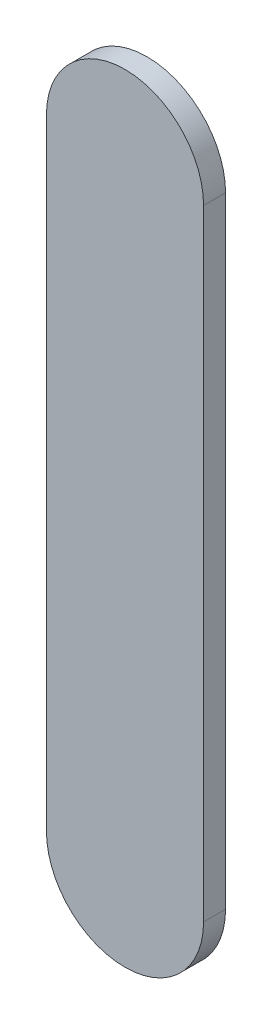
ISO-10303-21;
HEADER;
FILE_DESCRIPTION(('STEP AP214'),'2;1');
FILE_NAME('part.step','',(''),(''),'','','');
FILE_SCHEMA(('AUTOMOTIVE_DESIGN { 1 0 10303 214 1 1 1 1 }'));
ENDSEC;
DATA;
#1=APPLICATION_CONTEXT('core data for automotive mechanical design processes');
#2=APPLICATION_PROTOCOL_DEFINITION('international standard','automotive_design',2000,#1);
#3=PRODUCT_CONTEXT('',#1,'mechanical');
#4=PRODUCT('Part','Part','',(#3));
#5=PRODUCT_RELATED_PRODUCT_CATEGORY('part','',(#4));
#6=PRODUCT_DEFINITION_FORMATION('','',#4);
#7=PRODUCT_DEFINITION_CONTEXT('part definition',#1,'design');
#8=PRODUCT_DEFINITION('design','',#6,#7);
#9=PRODUCT_DEFINITION_SHAPE('','',#8);
#10=(LENGTH_UNIT() NAMED_UNIT(*) SI_UNIT(.MILLI.,.METRE.));
#11=(NAMED_UNIT(*) PLANE_ANGLE_UNIT() SI_UNIT($,.RADIAN.));
#12=(NAMED_UNIT(*) SI_UNIT($,.STERADIAN.) SOLID_ANGLE_UNIT());
#13=UNCERTAINTY_MEASURE_WITH_UNIT(LENGTH_MEASURE(1.E-05),#10,'distance_accuracy_value','');
#14=(GEOMETRIC_REPRESENTATION_CONTEXT(3) GLOBAL_UNCERTAINTY_ASSIGNED_CONTEXT((#13)) GLOBAL_UNIT_ASSIGNED_CONTEXT((#10,
#11,#12)) REPRESENTATION_CONTEXT('',''));
#15=CARTESIAN_POINT('',(0.,0.,0.));
#16=DIRECTION('',(0.,0.,1.));
#17=DIRECTION('',(1.,0.,0.));
#18=AXIS2_PLACEMENT_3D('',#15,#16,#17);
#19=CARTESIAN_POINT('',(91.4440132,99.08693162,0.));
#20=DIRECTION('',(-1.,0.,0.));
#21=DIRECTION('',(0.,1.,0.));
#22=AXIS2_PLACEMENT_3D('',#19,#20,#21);
#23=PLANE('',#22);
#24=DIRECTION('',(0.,1.,0.));
#25=VECTOR('',#24,1.);
#26=CARTESIAN_POINT('',(91.4440132,99.08693162,0.03556));
#27=LINE('',#26,#25);
#28=CARTESIAN_POINT('',(91.4440132,99.08693162,0.03556));
#29=VERTEX_POINT('',#28);
#30=CARTESIAN_POINT('',(91.4440132,100.0900208,0.03556));
#31=VERTEX_POINT('',#30);
#32=EDGE_CURVE('E11',#29,#31,#27,.T.);
#33=ORIENTED_EDGE('',*,*,#32,.F.);
#34=DIRECTION('',(0.,0.,1.));
#35=VECTOR('',#34,1.);
#36=CARTESIAN_POINT('',(91.4440132,99.08693162,0.));
#37=LINE('',#36,#35);
#38=CARTESIAN_POINT('',(91.4440132,99.08693162,0.));
#39=VERTEX_POINT('',#38);
#40=EDGE_CURVE('E24',#39,#29,#37,.T.);
#41=ORIENTED_EDGE('',*,*,#40,.F.);
#42=DIRECTION('',(0.,1.,0.));
#43=VECTOR('',#42,1.);
#44=CARTESIAN_POINT('',(91.4440132,99.08693162,0.));
#45=LINE('',#44,#43);
#46=CARTESIAN_POINT('',(91.4440132,100.0900208,0.));
#47=VERTEX_POINT('',#46);
#48=EDGE_CURVE('E75',#39,#47,#45,.T.);
#49=ORIENTED_EDGE('',*,*,#48,.T.);
#50=DIRECTION('',(0.,0.,1.));
#51=VECTOR('',#50,1.);
#52=CARTESIAN_POINT('',(91.4440132,100.0900208,0.));
#53=LINE('',#52,#51);
#54=EDGE_CURVE('E37',#47,#31,#53,.T.);
#55=ORIENTED_EDGE('',*,*,#54,.T.);
#56=EDGE_LOOP('',(#33,#41,#49,#55));
#57=FACE_BOUND('',#56,.T.);
#58=ADVANCED_FACE('F17',(#57),#23,.F.);
#59=CARTESIAN_POINT('',(91.3170132,100.0900208,0.));
#60=DIRECTION('',(0.,0.,-1.));
#61=DIRECTION('',(1.,1.1189649382048E-13,0.));
#62=AXIS2_PLACEMENT_3D('',#59,#60,#61);
#63=CYLINDRICAL_SURFACE('',#62,0.127000000000005);
#64=CARTESIAN_POINT('',(91.3170132,100.0900208,0.03556));
#65=DIRECTION('',(0.,0.,1.));
#66=DIRECTION('',(1.,1.1189649382048E-13,0.));
#67=AXIS2_PLACEMENT_3D('',#64,#65,#66);
#68=CIRCLE('',#67,0.127000000000005);
#69=CARTESIAN_POINT('',(91.1900132,100.0900208,0.03556));
#70=VERTEX_POINT('',#69);
#71=EDGE_CURVE('E83',#31,#70,#68,.T.);
#72=ORIENTED_EDGE('',*,*,#71,.F.);
#73=ORIENTED_EDGE('',*,*,#54,.F.);
#74=CARTESIAN_POINT('',(91.3170132,100.0900208,0.));
#75=DIRECTION('',(0.,0.,1.));
#76=DIRECTION('',(1.,1.1189649382048E-13,0.));
#77=AXIS2_PLACEMENT_3D('',#74,#75,#76);
#78=CIRCLE('',#77,0.127000000000005);
#79=CARTESIAN_POINT('',(91.1900132,100.0900208,0.));
#80=VERTEX_POINT('',#79);
#81=EDGE_CURVE('E81',#47,#80,#78,.T.);
#82=ORIENTED_EDGE('',*,*,#81,.T.);
#83=DIRECTION('',(0.,0.,1.));
#84=VECTOR('',#83,1.);
#85=CARTESIAN_POINT('',(91.1900132,100.0900208,0.));
#86=LINE('',#85,#84);
#87=EDGE_CURVE('E67',#80,#70,#86,.T.);
#88=ORIENTED_EDGE('',*,*,#87,.T.);
#89=EDGE_LOOP('',(#72,#73,#82,#88));
#90=FACE_BOUND('',#89,.T.);
#91=ADVANCED_FACE('F89',(#90),#63,.T.);
#92=CARTESIAN_POINT('',(91.1900132,100.0900208,0.));
#93=DIRECTION('',(1.,0.,0.));
#94=DIRECTION('',(0.,-1.,0.));
#95=AXIS2_PLACEMENT_3D('',#92,#93,#94);
#96=PLANE('',#95);
#97=DIRECTION('',(0.,-1.,0.));
#98=VECTOR('',#97,1.);
#99=CARTESIAN_POINT('',(91.1900132,100.0900208,0.03556));
#100=LINE('',#99,#98);
#101=CARTESIAN_POINT('',(91.1900132,99.08693162,0.03556));
#102=VERTEX_POINT('',#101);
#103=EDGE_CURVE('E71',#70,#102,#100,.T.);
#104=ORIENTED_EDGE('',*,*,#103,.F.);
#105=ORIENTED_EDGE('',*,*,#87,.F.);
#106=DIRECTION('',(0.,-1.,0.));
#107=VECTOR('',#106,1.);
#108=CARTESIAN_POINT('',(91.1900132,100.0900208,0.));
#109=LINE('',#108,#107);
#110=CARTESIAN_POINT('',(91.1900132,99.08693162,0.));
#111=VERTEX_POINT('',#110);
#112=EDGE_CURVE('E63',#80,#111,#109,.T.);
#113=ORIENTED_EDGE('',*,*,#112,.T.);
#114=DIRECTION('',(0.,0.,1.));
#115=VECTOR('',#114,1.);
#116=CARTESIAN_POINT('',(91.1900132,99.08693162,0.));
#117=LINE('',#116,#115);
#118=EDGE_CURVE('E53',#111,#102,#117,.T.);
#119=ORIENTED_EDGE('',*,*,#118,.T.);
#120=EDGE_LOOP('',(#104,#105,#113,#119));
#121=FACE_BOUND('',#120,.T.);
#122=ADVANCED_FACE('F66',(#121),#96,.F.);
#123=CARTESIAN_POINT('',(91.3170132,99.08693162,0.));
#124=DIRECTION('',(0.,0.,-1.));
#125=DIRECTION('',(-1.,0.,0.));
#126=AXIS2_PLACEMENT_3D('',#123,#124,#125);
#127=CYLINDRICAL_SURFACE('',#126,0.127);
#128=CARTESIAN_POINT('',(91.3170132,99.08693162,0.03556));
#129=DIRECTION('',(0.,0.,1.));
#130=DIRECTION('',(-1.,0.,0.));
#131=AXIS2_PLACEMENT_3D('',#128,#129,#130);
#132=CIRCLE('',#131,0.127);
#133=EDGE_CURVE('E59',#102,#29,#132,.T.);
#134=ORIENTED_EDGE('',*,*,#133,.F.);
#135=ORIENTED_EDGE('',*,*,#118,.F.);
#136=CARTESIAN_POINT('',(91.3170132,99.08693162,0.));
#137=DIRECTION('',(0.,0.,1.));
#138=DIRECTION('',(-1.,0.,0.));
#139=AXIS2_PLACEMENT_3D('',#136,#137,#138);
#140=CIRCLE('',#139,0.127);
#141=EDGE_CURVE('E57',#111,#39,#140,.T.);
#142=ORIENTED_EDGE('',*,*,#141,.T.);
#143=ORIENTED_EDGE('',*,*,#40,.T.);
#144=EDGE_LOOP('',(#134,#135,#142,#143));
#145=FACE_BOUND('',#144,.T.);
#146=ADVANCED_FACE('F55',(#145),#127,.T.);
#147=CARTESIAN_POINT('',(91.4440132,99.08693162,0.));
#148=DIRECTION('',(0.,0.,-1.));
#149=DIRECTION('',(-1.,0.,0.));
#150=AXIS2_PLACEMENT_3D('',#147,#148,#149);
#151=PLANE('',#150);
#152=ORIENTED_EDGE('',*,*,#141,.F.);
#153=ORIENTED_EDGE('',*,*,#112,.F.);
#154=ORIENTED_EDGE('',*,*,#81,.F.);
#155=ORIENTED_EDGE('',*,*,#48,.F.);
#156=EDGE_LOOP('',(#152,#153,#154,#155));
#157=FACE_BOUND('',#156,.T.);
#158=ADVANCED_FACE('F74',(#157),#151,.T.);
#159=CARTESIAN_POINT('',(91.4440132,99.08693162,0.03556));
#160=DIRECTION('',(0.,0.,-1.));
#161=DIRECTION('',(-1.,0.,0.));
#162=AXIS2_PLACEMENT_3D('',#159,#160,#161);
#163=PLANE('',#162);
#164=ORIENTED_EDGE('',*,*,#32,.T.);
#165=ORIENTED_EDGE('',*,*,#71,.T.);
#166=ORIENTED_EDGE('',*,*,#103,.T.);
#167=ORIENTED_EDGE('',*,*,#133,.T.);
#168=EDGE_LOOP('',(#164,#165,#166,#167));
#169=FACE_BOUND('',#168,.T.);
#170=ADVANCED_FACE('F91',(#169),#163,.F.);
#171=CLOSED_SHELL('',(#58,#91,#122,#146,#158,#170));
#172=MANIFOLD_SOLID_BREP('B1',#171);
#173=ADVANCED_BREP_SHAPE_REPRESENTATION('',(#18,#172),#14);
#174=SHAPE_DEFINITION_REPRESENTATION(#9,#173);
ENDSEC;
END-ISO-10303-21;
